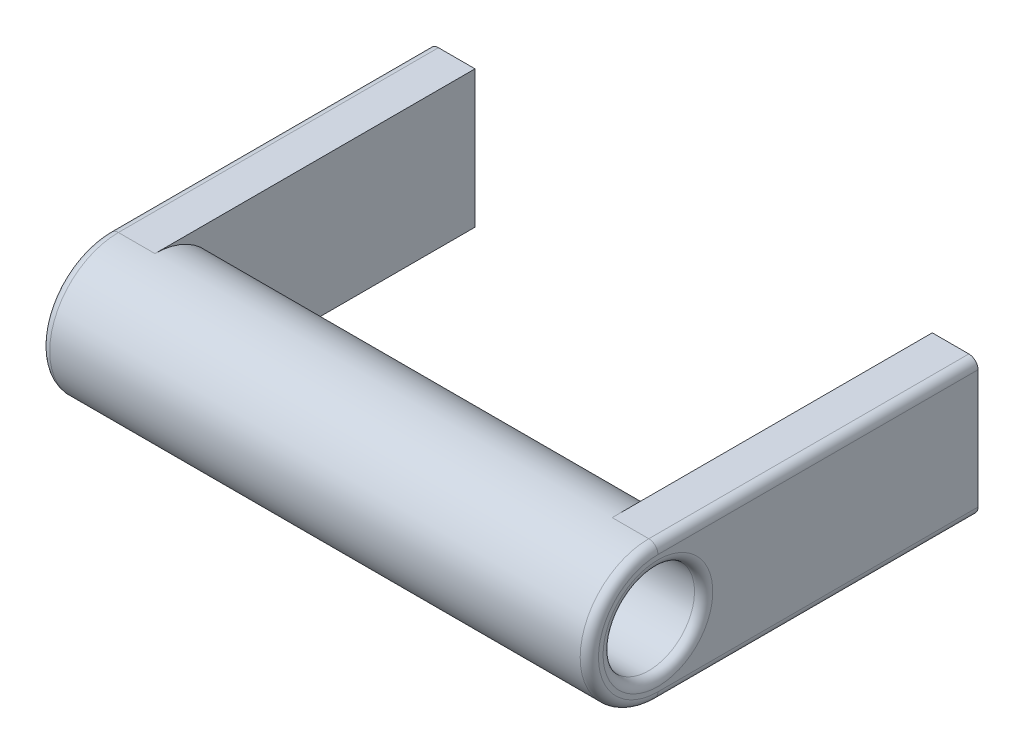
ISO-10303-21;
HEADER;
FILE_DESCRIPTION(('STEP AP214'),'2;1');
FILE_NAME('part.step','',(''),(''),'','','');
FILE_SCHEMA(('AUTOMOTIVE_DESIGN { 1 0 10303 214 1 1 1 1 }'));
ENDSEC;
DATA;
#1=APPLICATION_CONTEXT('core data for automotive mechanical design processes');
#2=APPLICATION_PROTOCOL_DEFINITION('international standard','automotive_design',2000,#1);
#3=PRODUCT_CONTEXT('',#1,'mechanical');
#4=PRODUCT('Part','Part','',(#3));
#5=PRODUCT_RELATED_PRODUCT_CATEGORY('part','',(#4));
#6=PRODUCT_DEFINITION_FORMATION('','',#4);
#7=PRODUCT_DEFINITION_CONTEXT('part definition',#1,'design');
#8=PRODUCT_DEFINITION('design','',#6,#7);
#9=PRODUCT_DEFINITION_SHAPE('','',#8);
#10=(LENGTH_UNIT() NAMED_UNIT(*) SI_UNIT(.MILLI.,.METRE.));
#11=(NAMED_UNIT(*) PLANE_ANGLE_UNIT() SI_UNIT($,.RADIAN.));
#12=(NAMED_UNIT(*) SI_UNIT($,.STERADIAN.) SOLID_ANGLE_UNIT());
#13=UNCERTAINTY_MEASURE_WITH_UNIT(LENGTH_MEASURE(1.E-05),#10,'distance_accuracy_value','');
#14=(GEOMETRIC_REPRESENTATION_CONTEXT(3) GLOBAL_UNCERTAINTY_ASSIGNED_CONTEXT((#13)) GLOBAL_UNIT_ASSIGNED_CONTEXT((#10,
#11,#12)) REPRESENTATION_CONTEXT('',''));
#15=CARTESIAN_POINT('',(0.,0.,0.));
#16=DIRECTION('',(0.,0.,1.));
#17=DIRECTION('',(1.,0.,0.));
#18=AXIS2_PLACEMENT_3D('',#15,#16,#17);
#19=CARTESIAN_POINT('',(-102.426406871193,0.,70.));
#20=DIRECTION('',(1.,0.,0.));
#21=DIRECTION('',(0.,0.,-1.));
#22=AXIS2_PLACEMENT_3D('',#19,#20,#21);
#23=CYLINDRICAL_SURFACE('',#22,15.);
#24=DIRECTION('',(1.,0.,0.));
#25=VECTOR('',#24,1.);
#26=CARTESIAN_POINT('',(60.,-15.,70.));
#27=LINE('',#26,#25);
#28=CARTESIAN_POINT('',(50.,-15.,70.));
#29=VERTEX_POINT('',#28);
#30=CARTESIAN_POINT('',(58.,-15.,70.));
#31=VERTEX_POINT('',#30);
#32=EDGE_CURVE('E169',#29,#31,#27,.T.);
#33=ORIENTED_EDGE('',*,*,#32,.T.);
#34=CARTESIAN_POINT('',(58.,0.,70.));
#35=DIRECTION('',(-1.,0.,0.));
#36=DIRECTION('',(0.,0.,1.));
#37=AXIS2_PLACEMENT_3D('',#34,#35,#36);
#38=CIRCLE('',#37,15.);
#39=CARTESIAN_POINT('',(58.,15.,70.));
#40=VERTEX_POINT('',#39);
#41=EDGE_CURVE('E206',#31,#40,#38,.T.);
#42=ORIENTED_EDGE('',*,*,#41,.T.);
#43=DIRECTION('',(-1.,0.,0.));
#44=VECTOR('',#43,1.);
#45=CARTESIAN_POINT('',(60.,15.,70.));
#46=LINE('',#45,#44);
#47=CARTESIAN_POINT('',(50.,15.,70.));
#48=VERTEX_POINT('',#47);
#49=EDGE_CURVE('E172',#40,#48,#46,.T.);
#50=ORIENTED_EDGE('',*,*,#49,.T.);
#51=CARTESIAN_POINT('',(50.,0.,70.));
#52=DIRECTION('',(1.,0.,0.));
#53=DIRECTION('',(0.,0.,-1.));
#54=AXIS2_PLACEMENT_3D('',#51,#52,#53);
#55=CIRCLE('',#54,15.);
#56=EDGE_CURVE('E164',#29,#48,#55,.T.);
#57=ORIENTED_EDGE('',*,*,#56,.F.);
#58=EDGE_LOOP('',(#33,#42,#50,#57));
#59=FACE_BOUND('',#58,.T.);
#60=DIRECTION('',(-1.,0.,0.));
#61=VECTOR('',#60,1.);
#62=CARTESIAN_POINT('',(-60.,15.,70.));
#63=LINE('',#62,#61);
#64=CARTESIAN_POINT('',(-50.,15.,70.));
#65=VERTEX_POINT('',#64);
#66=CARTESIAN_POINT('',(-58.,15.,70.));
#67=VERTEX_POINT('',#66);
#68=EDGE_CURVE('E148',#65,#67,#63,.T.);
#69=ORIENTED_EDGE('',*,*,#68,.T.);
#70=CARTESIAN_POINT('',(-58.,0.,70.));
#71=DIRECTION('',(1.,0.,0.));
#72=DIRECTION('',(0.,1.,0.));
#73=AXIS2_PLACEMENT_3D('',#70,#71,#72);
#74=CIRCLE('',#73,15.);
#75=CARTESIAN_POINT('',(-58.,-15.,70.));
#76=VERTEX_POINT('',#75);
#77=EDGE_CURVE('E208',#67,#76,#74,.T.);
#78=ORIENTED_EDGE('',*,*,#77,.T.);
#79=DIRECTION('',(1.,0.,0.));
#80=VECTOR('',#79,1.);
#81=CARTESIAN_POINT('',(-60.,-15.,70.));
#82=LINE('',#81,#80);
#83=CARTESIAN_POINT('',(-50.,-15.,70.));
#84=VERTEX_POINT('',#83);
#85=EDGE_CURVE('E155',#76,#84,#82,.T.);
#86=ORIENTED_EDGE('',*,*,#85,.T.);
#87=CARTESIAN_POINT('',(-50.,0.,70.));
#88=DIRECTION('',(-1.,0.,0.));
#89=DIRECTION('',(0.,-1.,0.));
#90=AXIS2_PLACEMENT_3D('',#87,#88,#89);
#91=CIRCLE('',#90,15.);
#92=EDGE_CURVE('E189',#84,#65,#91,.F.);
#93=ORIENTED_EDGE('',*,*,#92,.T.);
#94=EDGE_LOOP('',(#69,#78,#86,#93));
#95=FACE_BOUND('',#94,.T.);
#96=ADVANCED_FACE('F39',(#59,#95),#23,.T.);
#97=CARTESIAN_POINT('',(50.,-15.,70.));
#98=DIRECTION('',(1.,0.,0.));
#99=DIRECTION('',(0.,0.,-1.));
#100=AXIS2_PLACEMENT_3D('',#97,#98,#99);
#101=PLANE('',#100);
#102=DIRECTION('',(0.,0.,-1.));
#103=VECTOR('',#102,1.);
#104=CARTESIAN_POINT('',(50.,-15.,70.));
#105=LINE('',#104,#103);
#106=CARTESIAN_POINT('',(50.,-15.,0.));
#107=VERTEX_POINT('',#106);
#108=EDGE_CURVE('E186',#29,#107,#105,.T.);
#109=ORIENTED_EDGE('',*,*,#108,.F.);
#110=ORIENTED_EDGE('',*,*,#56,.T.);
#111=DIRECTION('',(0.,0.,-1.));
#112=VECTOR('',#111,1.);
#113=CARTESIAN_POINT('',(50.,15.,70.));
#114=LINE('',#113,#112);
#115=CARTESIAN_POINT('',(50.,15.,0.));
#116=VERTEX_POINT('',#115);
#117=EDGE_CURVE('E175',#48,#116,#114,.T.);
#118=ORIENTED_EDGE('',*,*,#117,.T.);
#119=DIRECTION('',(0.,-1.,0.));
#120=VECTOR('',#119,1.);
#121=CARTESIAN_POINT('',(50.,-15.,0.));
#122=LINE('',#121,#120);
#123=EDGE_CURVE('E168',#116,#107,#122,.T.);
#124=ORIENTED_EDGE('',*,*,#123,.T.);
#125=EDGE_LOOP('',(#109,#110,#118,#124));
#126=FACE_BOUND('',#125,.T.);
#127=ADVANCED_FACE('F301',(#126),#101,.F.);
#128=CARTESIAN_POINT('',(60.,-15.,70.));
#129=DIRECTION('',(0.,1.,0.));
#130=DIRECTION('',(0.,0.,1.));
#131=AXIS2_PLACEMENT_3D('',#128,#129,#130);
#132=PLANE('',#131);
#133=DIRECTION('',(1.,0.,0.));
#134=VECTOR('',#133,1.);
#135=CARTESIAN_POINT('',(60.,-15.,0.));
#136=LINE('',#135,#134);
#137=CARTESIAN_POINT('',(58.,-15.,0.));
#138=VERTEX_POINT('',#137);
#139=EDGE_CURVE('E178',#107,#138,#136,.T.);
#140=ORIENTED_EDGE('',*,*,#139,.T.);
#141=DIRECTION('',(0.,0.,-1.));
#142=VECTOR('',#141,1.);
#143=CARTESIAN_POINT('',(58.,-15.,70.));
#144=LINE('',#143,#142);
#145=EDGE_CURVE('E223',#138,#31,#144,.F.);
#146=ORIENTED_EDGE('',*,*,#145,.T.);
#147=ORIENTED_EDGE('',*,*,#32,.F.);
#148=ORIENTED_EDGE('',*,*,#108,.T.);
#149=EDGE_LOOP('',(#140,#146,#147,#148));
#150=FACE_BOUND('',#149,.T.);
#151=ADVANCED_FACE('F294',(#150),#132,.F.);
#152=CARTESIAN_POINT('',(60.,-15.,70.));
#153=DIRECTION('',(-1.,0.,0.));
#154=DIRECTION('',(0.,0.,1.));
#155=AXIS2_PLACEMENT_3D('',#152,#153,#154);
#156=PLANE('',#155);
#157=CARTESIAN_POINT('',(60.,0.,70.0000000000001));
#158=DIRECTION('',(-1.,0.,0.));
#159=DIRECTION('',(0.,0.,1.));
#160=AXIS2_PLACEMENT_3D('',#157,#158,#159);
#161=CIRCLE('',#160,12.);
#162=CARTESIAN_POINT('',(60.,0.,82.0000000000001));
#163=VERTEX_POINT('',#162);
#164=EDGE_CURVE('E217',#163,#163,#161,.T.);
#165=ORIENTED_EDGE('',*,*,#164,.T.);
#166=EDGE_LOOP('',(#165));
#167=FACE_BOUND('',#166,.T.);
#168=CARTESIAN_POINT('',(60.,0.,70.));
#169=DIRECTION('',(-1.,0.,0.));
#170=DIRECTION('',(0.,0.,1.));
#171=AXIS2_PLACEMENT_3D('',#168,#169,#170);
#172=CIRCLE('',#171,13.);
#173=CARTESIAN_POINT('',(60.,13.,70.));
#174=VERTEX_POINT('',#173);
#175=CARTESIAN_POINT('',(60.,-13.,70.));
#176=VERTEX_POINT('',#175);
#177=EDGE_CURVE('E212',#174,#176,#172,.F.);
#178=ORIENTED_EDGE('',*,*,#177,.T.);
#179=DIRECTION('',(0.,0.,-1.));
#180=VECTOR('',#179,1.);
#181=CARTESIAN_POINT('',(60.,-13.,70.));
#182=LINE('',#181,#180);
#183=CARTESIAN_POINT('',(60.,-13.,0.));
#184=VERTEX_POINT('',#183);
#185=EDGE_CURVE('E214',#176,#184,#182,.T.);
#186=ORIENTED_EDGE('',*,*,#185,.T.);
#187=DIRECTION('',(0.,1.,0.));
#188=VECTOR('',#187,1.);
#189=CARTESIAN_POINT('',(60.,-15.,0.));
#190=LINE('',#189,#188);
#191=CARTESIAN_POINT('',(60.,13.,0.));
#192=VERTEX_POINT('',#191);
#193=EDGE_CURVE('E180',#184,#192,#190,.T.);
#194=ORIENTED_EDGE('',*,*,#193,.T.);
#195=DIRECTION('',(0.,0.,-1.));
#196=VECTOR('',#195,1.);
#197=CARTESIAN_POINT('',(60.,13.,70.));
#198=LINE('',#197,#196);
#199=EDGE_CURVE('E210',#192,#174,#198,.F.);
#200=ORIENTED_EDGE('',*,*,#199,.T.);
#201=EDGE_LOOP('',(#178,#186,#194,#200));
#202=FACE_BOUND('',#201,.T.);
#203=ADVANCED_FACE('F284',(#167,#202),#156,.F.);
#204=CARTESIAN_POINT('',(60.,15.,70.));
#205=DIRECTION('',(0.,-1.,0.));
#206=DIRECTION('',(0.,0.,-1.));
#207=AXIS2_PLACEMENT_3D('',#204,#205,#206);
#208=PLANE('',#207);
#209=ORIENTED_EDGE('',*,*,#49,.F.);
#210=DIRECTION('',(0.,0.,-1.));
#211=VECTOR('',#210,1.);
#212=CARTESIAN_POINT('',(58.,15.,70.));
#213=LINE('',#212,#211);
#214=CARTESIAN_POINT('',(58.,15.,0.));
#215=VERTEX_POINT('',#214);
#216=EDGE_CURVE('E11',#40,#215,#213,.T.);
#217=ORIENTED_EDGE('',*,*,#216,.T.);
#218=DIRECTION('',(-1.,0.,0.));
#219=VECTOR('',#218,1.);
#220=CARTESIAN_POINT('',(60.,15.,0.));
#221=LINE('',#220,#219);
#222=EDGE_CURVE('E173',#215,#116,#221,.T.);
#223=ORIENTED_EDGE('',*,*,#222,.T.);
#224=ORIENTED_EDGE('',*,*,#117,.F.);
#225=EDGE_LOOP('',(#209,#217,#223,#224));
#226=FACE_BOUND('',#225,.T.);
#227=ADVANCED_FACE('F278',(#226),#208,.F.);
#228=CARTESIAN_POINT('',(0.,0.,0.));
#229=DIRECTION('',(0.,0.,1.));
#230=DIRECTION('',(1.,0.,0.));
#231=AXIS2_PLACEMENT_3D('',#228,#229,#230);
#232=PLANE('',#231);
#233=CARTESIAN_POINT('',(55.,-7.,0.));
#234=DIRECTION('',(0.,0.,-1.));
#235=DIRECTION('',(1.,0.,0.));
#236=AXIS2_PLACEMENT_3D('',#233,#234,#235);
#237=CIRCLE('',#236,1.50000000000001);
#238=CARTESIAN_POINT('',(56.5,-7.,0.));
#239=VERTEX_POINT('',#238);
#240=EDGE_CURVE('E251',#239,#239,#237,.T.);
#241=ORIENTED_EDGE('',*,*,#240,.F.);
#242=EDGE_LOOP('',(#241));
#243=FACE_BOUND('',#242,.T.);
#244=CARTESIAN_POINT('',(55.,7.,0.));
#245=DIRECTION('',(0.,0.,-1.));
#246=DIRECTION('',(-1.,0.,0.));
#247=AXIS2_PLACEMENT_3D('',#244,#245,#246);
#248=CIRCLE('',#247,1.5);
#249=CARTESIAN_POINT('',(53.5,7.,0.));
#250=VERTEX_POINT('',#249);
#251=EDGE_CURVE('E246',#250,#250,#248,.T.);
#252=ORIENTED_EDGE('',*,*,#251,.F.);
#253=EDGE_LOOP('',(#252));
#254=FACE_BOUND('',#253,.T.);
#255=ORIENTED_EDGE('',*,*,#193,.F.);
#256=CARTESIAN_POINT('',(58.,-13.,0.));
#257=DIRECTION('',(0.,0.,1.));
#258=DIRECTION('',(1.,0.,0.));
#259=AXIS2_PLACEMENT_3D('',#256,#257,#258);
#260=CIRCLE('',#259,2.);
#261=EDGE_CURVE('E56',#184,#138,#260,.F.);
#262=ORIENTED_EDGE('',*,*,#261,.T.);
#263=ORIENTED_EDGE('',*,*,#139,.F.);
#264=ORIENTED_EDGE('',*,*,#123,.F.);
#265=ORIENTED_EDGE('',*,*,#222,.F.);
#266=CARTESIAN_POINT('',(58.,13.,0.));
#267=DIRECTION('',(0.,0.,1.));
#268=DIRECTION('',(1.,0.,0.));
#269=AXIS2_PLACEMENT_3D('',#266,#267,#268);
#270=CIRCLE('',#269,2.);
#271=EDGE_CURVE('E220',#215,#192,#270,.F.);
#272=ORIENTED_EDGE('',*,*,#271,.T.);
#273=EDGE_LOOP('',(#255,#262,#263,#264,#265,#272));
#274=FACE_BOUND('',#273,.T.);
#275=ADVANCED_FACE('F274',(#243,#254,#274),#232,.F.);
#276=CARTESIAN_POINT('',(-60.,-15.,70.));
#277=DIRECTION('',(1.,0.,0.));
#278=DIRECTION('',(0.,1.,0.));
#279=AXIS2_PLACEMENT_3D('',#276,#277,#278);
#280=PLANE('',#279);
#281=CARTESIAN_POINT('',(-60.,0.,70.0000000000001));
#282=DIRECTION('',(1.,0.,0.));
#283=DIRECTION('',(0.,1.,0.));
#284=AXIS2_PLACEMENT_3D('',#281,#282,#283);
#285=CIRCLE('',#284,12.);
#286=CARTESIAN_POINT('',(-60.,12.,70.0000000000001));
#287=VERTEX_POINT('',#286);
#288=EDGE_CURVE('E203',#287,#287,#285,.T.);
#289=ORIENTED_EDGE('',*,*,#288,.T.);
#290=EDGE_LOOP('',(#289));
#291=FACE_BOUND('',#290,.T.);
#292=DIRECTION('',(0.,-1.,0.));
#293=VECTOR('',#292,1.);
#294=CARTESIAN_POINT('',(-60.,-15.,0.));
#295=LINE('',#294,#293);
#296=CARTESIAN_POINT('',(-60.,13.,0.));
#297=VERTEX_POINT('',#296);
#298=CARTESIAN_POINT('',(-60.,-13.,0.));
#299=VERTEX_POINT('',#298);
#300=EDGE_CURVE('E161',#297,#299,#295,.T.);
#301=ORIENTED_EDGE('',*,*,#300,.T.);
#302=DIRECTION('',(0.,0.,-1.));
#303=VECTOR('',#302,1.);
#304=CARTESIAN_POINT('',(-60.,-13.,70.));
#305=LINE('',#304,#303);
#306=CARTESIAN_POINT('',(-60.,-13.,70.));
#307=VERTEX_POINT('',#306);
#308=EDGE_CURVE('E201',#299,#307,#305,.F.);
#309=ORIENTED_EDGE('',*,*,#308,.T.);
#310=CARTESIAN_POINT('',(-60.,0.,70.));
#311=DIRECTION('',(1.,0.,0.));
#312=DIRECTION('',(0.,1.,0.));
#313=AXIS2_PLACEMENT_3D('',#310,#311,#312);
#314=CIRCLE('',#313,13.);
#315=CARTESIAN_POINT('',(-60.,13.,70.));
#316=VERTEX_POINT('',#315);
#317=EDGE_CURVE('E199',#307,#316,#314,.F.);
#318=ORIENTED_EDGE('',*,*,#317,.T.);
#319=DIRECTION('',(0.,0.,-1.));
#320=VECTOR('',#319,1.);
#321=CARTESIAN_POINT('',(-60.,13.,70.));
#322=LINE('',#321,#320);
#323=EDGE_CURVE('E197',#316,#297,#322,.T.);
#324=ORIENTED_EDGE('',*,*,#323,.T.);
#325=EDGE_LOOP('',(#301,#309,#318,#324));
#326=FACE_BOUND('',#325,.T.);
#327=ADVANCED_FACE('F277',(#291,#326),#280,.F.);
#328=CARTESIAN_POINT('',(-60.,-15.,70.));
#329=DIRECTION('',(0.,1.,0.));
#330=DIRECTION('',(0.,0.,1.));
#331=AXIS2_PLACEMENT_3D('',#328,#329,#330);
#332=PLANE('',#331);
#333=ORIENTED_EDGE('',*,*,#85,.F.);
#334=DIRECTION('',(0.,0.,-1.));
#335=VECTOR('',#334,1.);
#336=CARTESIAN_POINT('',(-58.,-15.,70.));
#337=LINE('',#336,#335);
#338=CARTESIAN_POINT('',(-58.,-15.,0.));
#339=VERTEX_POINT('',#338);
#340=EDGE_CURVE('E191',#76,#339,#337,.T.);
#341=ORIENTED_EDGE('',*,*,#340,.T.);
#342=DIRECTION('',(1.,0.,0.));
#343=VECTOR('',#342,1.);
#344=CARTESIAN_POINT('',(-60.,-15.,0.));
#345=LINE('',#344,#343);
#346=CARTESIAN_POINT('',(-50.,-15.,0.));
#347=VERTEX_POINT('',#346);
#348=EDGE_CURVE('E140',#339,#347,#345,.T.);
#349=ORIENTED_EDGE('',*,*,#348,.T.);
#350=DIRECTION('',(0.,0.,-1.));
#351=VECTOR('',#350,1.);
#352=CARTESIAN_POINT('',(-50.,-15.,70.));
#353=LINE('',#352,#351);
#354=EDGE_CURVE('E136',#84,#347,#353,.T.);
#355=ORIENTED_EDGE('',*,*,#354,.F.);
#356=EDGE_LOOP('',(#333,#341,#349,#355));
#357=FACE_BOUND('',#356,.T.);
#358=ADVANCED_FACE('F321',(#357),#332,.F.);
#359=CARTESIAN_POINT('',(-50.,-15.,70.));
#360=DIRECTION('',(-1.,0.,0.));
#361=DIRECTION('',(0.,-1.,0.));
#362=AXIS2_PLACEMENT_3D('',#359,#360,#361);
#363=PLANE('',#362);
#364=ORIENTED_EDGE('',*,*,#92,.F.);
#365=ORIENTED_EDGE('',*,*,#354,.T.);
#366=DIRECTION('',(0.,1.,0.));
#367=VECTOR('',#366,1.);
#368=CARTESIAN_POINT('',(-50.,-15.,0.));
#369=LINE('',#368,#367);
#370=CARTESIAN_POINT('',(-50.,15.,0.));
#371=VERTEX_POINT('',#370);
#372=EDGE_CURVE('E129',#347,#371,#369,.T.);
#373=ORIENTED_EDGE('',*,*,#372,.T.);
#374=DIRECTION('',(0.,0.,-1.));
#375=VECTOR('',#374,1.);
#376=CARTESIAN_POINT('',(-50.,15.,70.));
#377=LINE('',#376,#375);
#378=EDGE_CURVE('E133',#65,#371,#377,.T.);
#379=ORIENTED_EDGE('',*,*,#378,.F.);
#380=EDGE_LOOP('',(#364,#365,#373,#379));
#381=FACE_BOUND('',#380,.T.);
#382=ADVANCED_FACE('F132',(#381),#363,.F.);
#383=CARTESIAN_POINT('',(-60.,15.,70.));
#384=DIRECTION('',(0.,-1.,0.));
#385=DIRECTION('',(0.,0.,-1.));
#386=AXIS2_PLACEMENT_3D('',#383,#384,#385);
#387=PLANE('',#386);
#388=DIRECTION('',(-1.,0.,0.));
#389=VECTOR('',#388,1.);
#390=CARTESIAN_POINT('',(-60.,15.,0.));
#391=LINE('',#390,#389);
#392=CARTESIAN_POINT('',(-58.,15.,0.));
#393=VERTEX_POINT('',#392);
#394=EDGE_CURVE('E141',#371,#393,#391,.T.);
#395=ORIENTED_EDGE('',*,*,#394,.T.);
#396=DIRECTION('',(0.,0.,-1.));
#397=VECTOR('',#396,1.);
#398=CARTESIAN_POINT('',(-58.,15.,70.));
#399=LINE('',#398,#397);
#400=EDGE_CURVE('E48',#393,#67,#399,.F.);
#401=ORIENTED_EDGE('',*,*,#400,.T.);
#402=ORIENTED_EDGE('',*,*,#68,.F.);
#403=ORIENTED_EDGE('',*,*,#378,.T.);
#404=EDGE_LOOP('',(#395,#401,#402,#403));
#405=FACE_BOUND('',#404,.T.);
#406=ADVANCED_FACE('F145',(#405),#387,.F.);
#407=CARTESIAN_POINT('',(0.,0.,0.));
#408=DIRECTION('',(0.,0.,-1.));
#409=DIRECTION('',(-1.,0.,0.));
#410=AXIS2_PLACEMENT_3D('',#407,#408,#409);
#411=PLANE('',#410);
#412=CARTESIAN_POINT('',(-55.,7.,0.));
#413=DIRECTION('',(0.,0.,-1.));
#414=DIRECTION('',(1.,0.,0.));
#415=AXIS2_PLACEMENT_3D('',#412,#413,#414);
#416=CIRCLE('',#415,1.5);
#417=CARTESIAN_POINT('',(-53.5,7.,0.));
#418=VERTEX_POINT('',#417);
#419=EDGE_CURVE('E257',#418,#418,#416,.T.);
#420=ORIENTED_EDGE('',*,*,#419,.F.);
#421=EDGE_LOOP('',(#420));
#422=FACE_BOUND('',#421,.T.);
#423=CARTESIAN_POINT('',(-55.,-7.,0.));
#424=DIRECTION('',(0.,0.,-1.));
#425=DIRECTION('',(-1.,0.,0.));
#426=AXIS2_PLACEMENT_3D('',#423,#424,#425);
#427=CIRCLE('',#426,1.50000000000001);
#428=CARTESIAN_POINT('',(-56.5,-7.,0.));
#429=VERTEX_POINT('',#428);
#430=EDGE_CURVE('E263',#429,#429,#427,.T.);
#431=ORIENTED_EDGE('',*,*,#430,.F.);
#432=EDGE_LOOP('',(#431));
#433=FACE_BOUND('',#432,.T.);
#434=ORIENTED_EDGE('',*,*,#348,.F.);
#435=CARTESIAN_POINT('',(-58.,-13.,0.));
#436=DIRECTION('',(0.,0.,-1.));
#437=DIRECTION('',(-1.,0.,0.));
#438=AXIS2_PLACEMENT_3D('',#435,#436,#437);
#439=CIRCLE('',#438,2.);
#440=EDGE_CURVE('E195',#339,#299,#439,.T.);
#441=ORIENTED_EDGE('',*,*,#440,.T.);
#442=ORIENTED_EDGE('',*,*,#300,.F.);
#443=CARTESIAN_POINT('',(-58.,13.,0.));
#444=DIRECTION('',(0.,0.,-1.));
#445=DIRECTION('',(-1.,0.,0.));
#446=AXIS2_PLACEMENT_3D('',#443,#444,#445);
#447=CIRCLE('',#446,2.);
#448=EDGE_CURVE('E154',#297,#393,#447,.T.);
#449=ORIENTED_EDGE('',*,*,#448,.T.);
#450=ORIENTED_EDGE('',*,*,#394,.F.);
#451=ORIENTED_EDGE('',*,*,#372,.F.);
#452=EDGE_LOOP('',(#434,#441,#442,#449,#450,#451));
#453=FACE_BOUND('',#452,.T.);
#454=ADVANCED_FACE('F151',(#422,#433,#453),#411,.T.);
#455=CARTESIAN_POINT('',(-60.000012,0.,70.0000000000001));
#456=DIRECTION('',(1.,0.,0.));
#457=DIRECTION('',(0.,1.,0.));
#458=AXIS2_PLACEMENT_3D('',#455,#456,#457);
#459=CYLINDRICAL_SURFACE('',#458,9.99999999999999);
#460=CARTESIAN_POINT('',(-58.,0.,70.0000000000001));
#461=DIRECTION('',(1.,0.,0.));
#462=DIRECTION('',(0.,1.,0.));
#463=AXIS2_PLACEMENT_3D('',#460,#461,#462);
#464=CIRCLE('',#463,9.99999999999999);
#465=CARTESIAN_POINT('',(-58.,9.99999999999999,70.0000000000001));
#466=VERTEX_POINT('',#465);
#467=EDGE_CURVE('E228',#466,#466,#464,.F.);
#468=ORIENTED_EDGE('',*,*,#467,.T.);
#469=EDGE_LOOP('',(#468));
#470=FACE_BOUND('',#469,.T.);
#471=CARTESIAN_POINT('',(58.,0.,70.0000000000001));
#472=DIRECTION('',(-1.,0.,0.));
#473=DIRECTION('',(0.,0.,1.));
#474=AXIS2_PLACEMENT_3D('',#471,#472,#473);
#475=CIRCLE('',#474,9.99999999999999);
#476=CARTESIAN_POINT('',(58.,0.,80.0000000000001));
#477=VERTEX_POINT('',#476);
#478=EDGE_CURVE('E225',#477,#477,#475,.F.);
#479=ORIENTED_EDGE('',*,*,#478,.T.);
#480=EDGE_LOOP('',(#479));
#481=FACE_BOUND('',#480,.T.);
#482=ADVANCED_FACE('F325',(#470,#481),#459,.F.);
#483=CARTESIAN_POINT('',(-58.,13.,70.));
#484=DIRECTION('',(0.,0.,-1.));
#485=DIRECTION('',(-1.,0.,0.));
#486=AXIS2_PLACEMENT_3D('',#483,#484,#485);
#487=CYLINDRICAL_SURFACE('',#486,2.);
#488=ORIENTED_EDGE('',*,*,#448,.F.);
#489=ORIENTED_EDGE('',*,*,#323,.F.);
#490=CARTESIAN_POINT('',(-58.,13.,70.));
#491=DIRECTION('',(0.,0.,1.));
#492=DIRECTION('',(1.,0.,0.));
#493=AXIS2_PLACEMENT_3D('',#490,#491,#492);
#494=CIRCLE('',#493,2.);
#495=EDGE_CURVE('E235',#67,#316,#494,.T.);
#496=ORIENTED_EDGE('',*,*,#495,.F.);
#497=ORIENTED_EDGE('',*,*,#400,.F.);
#498=EDGE_LOOP('',(#488,#489,#496,#497));
#499=FACE_BOUND('',#498,.T.);
#500=ADVANCED_FACE('F335',(#499),#487,.T.);
#501=CARTESIAN_POINT('',(-58.,0.,70.));
#502=DIRECTION('',(1.,0.,0.));
#503=DIRECTION('',(0.,1.,0.));
#504=AXIS2_PLACEMENT_3D('',#501,#502,#503);
#505=TOROIDAL_SURFACE('',#504,13.,2.);
#506=ORIENTED_EDGE('',*,*,#495,.T.);
#507=ORIENTED_EDGE('',*,*,#317,.F.);
#508=CARTESIAN_POINT('',(-58.,-13.,70.));
#509=DIRECTION('',(0.,0.,-1.));
#510=DIRECTION('',(-1.,0.,0.));
#511=AXIS2_PLACEMENT_3D('',#508,#509,#510);
#512=CIRCLE('',#511,2.);
#513=EDGE_CURVE('E232',#76,#307,#512,.T.);
#514=ORIENTED_EDGE('',*,*,#513,.F.);
#515=ORIENTED_EDGE('',*,*,#77,.F.);
#516=EDGE_LOOP('',(#506,#507,#514,#515));
#517=FACE_BOUND('',#516,.T.);
#518=ADVANCED_FACE('F452',(#517),#505,.T.);
#519=CARTESIAN_POINT('',(-58.,-13.,70.));
#520=DIRECTION('',(0.,0.,-1.));
#521=DIRECTION('',(-1.,0.,0.));
#522=AXIS2_PLACEMENT_3D('',#519,#520,#521);
#523=CYLINDRICAL_SURFACE('',#522,2.);
#524=ORIENTED_EDGE('',*,*,#513,.T.);
#525=ORIENTED_EDGE('',*,*,#308,.F.);
#526=ORIENTED_EDGE('',*,*,#440,.F.);
#527=ORIENTED_EDGE('',*,*,#340,.F.);
#528=EDGE_LOOP('',(#524,#525,#526,#527));
#529=FACE_BOUND('',#528,.T.);
#530=ADVANCED_FACE('F444',(#529),#523,.T.);
#531=CARTESIAN_POINT('',(58.,13.,70.));
#532=DIRECTION('',(0.,0.,-1.));
#533=DIRECTION('',(-1.,0.,0.));
#534=AXIS2_PLACEMENT_3D('',#531,#532,#533);
#535=CYLINDRICAL_SURFACE('',#534,2.);
#536=ORIENTED_EDGE('',*,*,#271,.F.);
#537=ORIENTED_EDGE('',*,*,#216,.F.);
#538=CARTESIAN_POINT('',(58.,13.,70.));
#539=DIRECTION('',(0.,0.,1.));
#540=DIRECTION('',(1.,0.,0.));
#541=AXIS2_PLACEMENT_3D('',#538,#539,#540);
#542=CIRCLE('',#541,2.);
#543=EDGE_CURVE('E43',#174,#40,#542,.T.);
#544=ORIENTED_EDGE('',*,*,#543,.F.);
#545=ORIENTED_EDGE('',*,*,#199,.F.);
#546=EDGE_LOOP('',(#536,#537,#544,#545));
#547=FACE_BOUND('',#546,.T.);
#548=ADVANCED_FACE('F287',(#547),#535,.T.);
#549=CARTESIAN_POINT('',(58.,0.,70.));
#550=DIRECTION('',(-1.,0.,0.));
#551=DIRECTION('',(0.,0.,1.));
#552=AXIS2_PLACEMENT_3D('',#549,#550,#551);
#553=TOROIDAL_SURFACE('',#552,13.,2.);
#554=ORIENTED_EDGE('',*,*,#543,.T.);
#555=ORIENTED_EDGE('',*,*,#41,.F.);
#556=CARTESIAN_POINT('',(58.,-13.,70.));
#557=DIRECTION('',(0.,0.,-1.));
#558=DIRECTION('',(-1.,0.,0.));
#559=AXIS2_PLACEMENT_3D('',#556,#557,#558);
#560=CIRCLE('',#559,2.);
#561=EDGE_CURVE('E237',#176,#31,#560,.T.);
#562=ORIENTED_EDGE('',*,*,#561,.F.);
#563=ORIENTED_EDGE('',*,*,#177,.F.);
#564=EDGE_LOOP('',(#554,#555,#562,#563));
#565=FACE_BOUND('',#564,.T.);
#566=ADVANCED_FACE('F291',(#565),#553,.T.);
#567=CARTESIAN_POINT('',(58.,-13.,70.));
#568=DIRECTION('',(0.,0.,-1.));
#569=DIRECTION('',(-1.,0.,0.));
#570=AXIS2_PLACEMENT_3D('',#567,#568,#569);
#571=CYLINDRICAL_SURFACE('',#570,2.);
#572=ORIENTED_EDGE('',*,*,#561,.T.);
#573=ORIENTED_EDGE('',*,*,#145,.F.);
#574=ORIENTED_EDGE('',*,*,#261,.F.);
#575=ORIENTED_EDGE('',*,*,#185,.F.);
#576=EDGE_LOOP('',(#572,#573,#574,#575));
#577=FACE_BOUND('',#576,.T.);
#578=ADVANCED_FACE('F292',(#577),#571,.T.);
#579=CARTESIAN_POINT('',(-58.,0.,70.0000000000001));
#580=DIRECTION('',(1.,0.,0.));
#581=DIRECTION('',(0.,1.,0.));
#582=AXIS2_PLACEMENT_3D('',#579,#580,#581);
#583=TOROIDAL_SURFACE('',#582,12.,2.);
#584=ORIENTED_EDGE('',*,*,#288,.F.);
#585=EDGE_LOOP('',(#584));
#586=FACE_BOUND('',#585,.T.);
#587=ORIENTED_EDGE('',*,*,#467,.F.);
#588=EDGE_LOOP('',(#587));
#589=FACE_BOUND('',#588,.T.);
#590=ADVANCED_FACE('F415',(#586,#589),#583,.T.);
#591=CARTESIAN_POINT('',(58.,0.,70.0000000000001));
#592=DIRECTION('',(-1.,0.,0.));
#593=DIRECTION('',(0.,0.,1.));
#594=AXIS2_PLACEMENT_3D('',#591,#592,#593);
#595=TOROIDAL_SURFACE('',#594,12.,2.);
#596=ORIENTED_EDGE('',*,*,#164,.F.);
#597=EDGE_LOOP('',(#596));
#598=FACE_BOUND('',#597,.T.);
#599=ORIENTED_EDGE('',*,*,#478,.F.);
#600=EDGE_LOOP('',(#599));
#601=FACE_BOUND('',#600,.T.);
#602=ADVANCED_FACE('F41',(#598,#601),#595,.T.);
#603=CARTESIAN_POINT('',(-55.,-7.,15.));
#604=DIRECTION('',(0.,0.,-1.));
#605=DIRECTION('',(-1.,0.,0.));
#606=AXIS2_PLACEMENT_3D('',#603,#604,#605);
#607=CYLINDRICAL_SURFACE('',#606,1.50000000000001);
#608=CARTESIAN_POINT('',(-55.,-7.,15.));
#609=DIRECTION('',(0.,0.,-1.));
#610=DIRECTION('',(-1.,0.,0.));
#611=AXIS2_PLACEMENT_3D('',#608,#609,#610);
#612=CIRCLE('',#611,1.50000000000001);
#613=CARTESIAN_POINT('',(-56.5,-7.,15.));
#614=VERTEX_POINT('',#613);
#615=EDGE_CURVE('E260',#614,#614,#612,.T.);
#616=ORIENTED_EDGE('',*,*,#615,.F.);
#617=EDGE_LOOP('',(#616));
#618=FACE_BOUND('',#617,.T.);
#619=ORIENTED_EDGE('',*,*,#430,.T.);
#620=EDGE_LOOP('',(#619));
#621=FACE_BOUND('',#620,.T.);
#622=ADVANCED_FACE('F355',(#618,#621),#607,.F.);
#623=CARTESIAN_POINT('',(-55.,-7.,15.));
#624=DIRECTION('',(0.,0.,-1.));
#625=DIRECTION('',(-1.,0.,0.));
#626=AXIS2_PLACEMENT_3D('',#623,#624,#625);
#627=PLANE('',#626);
#628=ORIENTED_EDGE('',*,*,#615,.T.);
#629=EDGE_LOOP('',(#628));
#630=FACE_BOUND('',#629,.T.);
#631=ADVANCED_FACE('F351',(#630),#627,.T.);
#632=CARTESIAN_POINT('',(-55.,7.,15.));
#633=DIRECTION('',(0.,0.,-1.));
#634=DIRECTION('',(-1.,0.,0.));
#635=AXIS2_PLACEMENT_3D('',#632,#633,#634);
#636=CYLINDRICAL_SURFACE('',#635,1.5);
#637=CARTESIAN_POINT('',(-55.,7.,15.));
#638=DIRECTION('',(0.,0.,-1.));
#639=DIRECTION('',(1.,0.,0.));
#640=AXIS2_PLACEMENT_3D('',#637,#638,#639);
#641=CIRCLE('',#640,1.5);
#642=CARTESIAN_POINT('',(-53.5,7.,15.));
#643=VERTEX_POINT('',#642);
#644=EDGE_CURVE('E254',#643,#643,#641,.T.);
#645=ORIENTED_EDGE('',*,*,#644,.F.);
#646=EDGE_LOOP('',(#645));
#647=FACE_BOUND('',#646,.T.);
#648=ORIENTED_EDGE('',*,*,#419,.T.);
#649=EDGE_LOOP('',(#648));
#650=FACE_BOUND('',#649,.T.);
#651=ADVANCED_FACE('F347',(#647,#650),#636,.F.);
#652=CARTESIAN_POINT('',(-55.,7.,15.));
#653=DIRECTION('',(0.,0.,1.));
#654=DIRECTION('',(1.,0.,0.));
#655=AXIS2_PLACEMENT_3D('',#652,#653,#654);
#656=PLANE('',#655);
#657=ORIENTED_EDGE('',*,*,#644,.T.);
#658=EDGE_LOOP('',(#657));
#659=FACE_BOUND('',#658,.T.);
#660=ADVANCED_FACE('F341',(#659),#656,.F.);
#661=CARTESIAN_POINT('',(55.,7.,15.));
#662=DIRECTION('',(0.,0.,-1.));
#663=DIRECTION('',(-1.,0.,0.));
#664=AXIS2_PLACEMENT_3D('',#661,#662,#663);
#665=CYLINDRICAL_SURFACE('',#664,1.5);
#666=CARTESIAN_POINT('',(55.,7.,15.));
#667=DIRECTION('',(0.,0.,-1.));
#668=DIRECTION('',(-1.,0.,0.));
#669=AXIS2_PLACEMENT_3D('',#666,#667,#668);
#670=CIRCLE('',#669,1.5);
#671=CARTESIAN_POINT('',(53.5,7.,15.));
#672=VERTEX_POINT('',#671);
#673=EDGE_CURVE('E239',#672,#672,#670,.T.);
#674=ORIENTED_EDGE('',*,*,#673,.F.);
#675=EDGE_LOOP('',(#674));
#676=FACE_BOUND('',#675,.T.);
#677=ORIENTED_EDGE('',*,*,#251,.T.);
#678=EDGE_LOOP('',(#677));
#679=FACE_BOUND('',#678,.T.);
#680=ADVANCED_FACE('F337',(#676,#679),#665,.F.);
#681=CARTESIAN_POINT('',(55.,7.,15.));
#682=DIRECTION('',(0.,0.,-1.));
#683=DIRECTION('',(-1.,0.,0.));
#684=AXIS2_PLACEMENT_3D('',#681,#682,#683);
#685=PLANE('',#684);
#686=ORIENTED_EDGE('',*,*,#673,.T.);
#687=EDGE_LOOP('',(#686));
#688=FACE_BOUND('',#687,.T.);
#689=ADVANCED_FACE('F340',(#688),#685,.T.);
#690=CARTESIAN_POINT('',(55.,-7.,15.));
#691=DIRECTION('',(0.,0.,-1.));
#692=DIRECTION('',(-1.,0.,0.));
#693=AXIS2_PLACEMENT_3D('',#690,#691,#692);
#694=CYLINDRICAL_SURFACE('',#693,1.50000000000001);
#695=CARTESIAN_POINT('',(55.,-7.,15.));
#696=DIRECTION('',(0.,0.,-1.));
#697=DIRECTION('',(1.,0.,0.));
#698=AXIS2_PLACEMENT_3D('',#695,#696,#697);
#699=CIRCLE('',#698,1.50000000000001);
#700=CARTESIAN_POINT('',(56.5,-7.,15.));
#701=VERTEX_POINT('',#700);
#702=EDGE_CURVE('E266',#701,#701,#699,.T.);
#703=ORIENTED_EDGE('',*,*,#702,.F.);
#704=EDGE_LOOP('',(#703));
#705=FACE_BOUND('',#704,.T.);
#706=ORIENTED_EDGE('',*,*,#240,.T.);
#707=EDGE_LOOP('',(#706));
#708=FACE_BOUND('',#707,.T.);
#709=ADVANCED_FACE('F272',(#705,#708),#694,.F.);
#710=CARTESIAN_POINT('',(55.,-7.,15.));
#711=DIRECTION('',(0.,0.,1.));
#712=DIRECTION('',(1.,0.,0.));
#713=AXIS2_PLACEMENT_3D('',#710,#711,#712);
#714=PLANE('',#713);
#715=ORIENTED_EDGE('',*,*,#702,.T.);
#716=EDGE_LOOP('',(#715));
#717=FACE_BOUND('',#716,.T.);
#718=ADVANCED_FACE('F360',(#717),#714,.F.);
#719=CLOSED_SHELL('',(#96,#127,#151,#203,#227,#275,#327,#358,#382,#406,#454,#482,#500,#518,#530,
#548,#566,#578,#590,#602,#622,#631,#651,#660,#680,#689,#709,#718));
#720=MANIFOLD_SOLID_BREP('B2',#719);
#721=ADVANCED_BREP_SHAPE_REPRESENTATION('',(#18,#720),#14);
#722=SHAPE_DEFINITION_REPRESENTATION(#9,#721);
ENDSEC;
END-ISO-10303-21;
